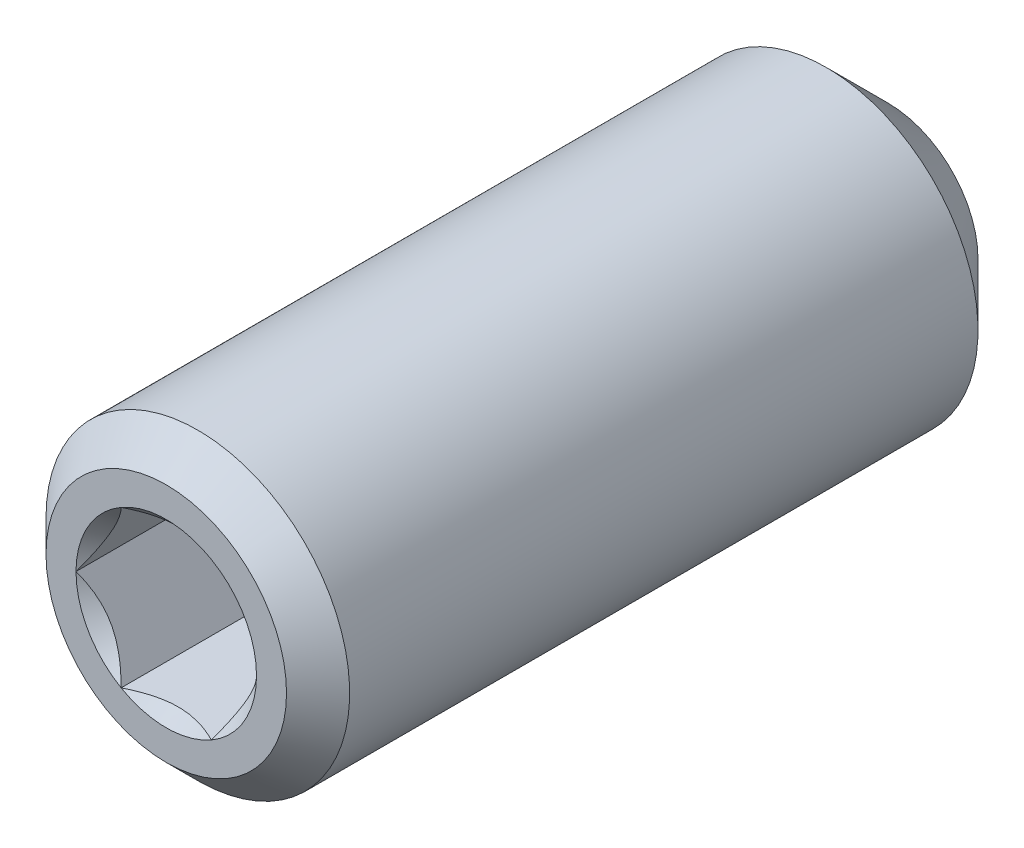
ISO-10303-21;
HEADER;
FILE_DESCRIPTION(('STEP AP214'),'2;1');
FILE_NAME('part.step','',(''),(''),'','','');
FILE_SCHEMA(('AUTOMOTIVE_DESIGN { 1 0 10303 214 1 1 1 1 }'));
ENDSEC;
DATA;
#1=APPLICATION_CONTEXT('core data for automotive mechanical design processes');
#2=APPLICATION_PROTOCOL_DEFINITION('international standard','automotive_design',2000,#1);
#3=PRODUCT_CONTEXT('',#1,'mechanical');
#4=PRODUCT('Part','Part','',(#3));
#5=PRODUCT_RELATED_PRODUCT_CATEGORY('part','',(#4));
#6=PRODUCT_DEFINITION_FORMATION('','',#4);
#7=PRODUCT_DEFINITION_CONTEXT('part definition',#1,'design');
#8=PRODUCT_DEFINITION('design','',#6,#7);
#9=PRODUCT_DEFINITION_SHAPE('','',#8);
#10=(LENGTH_UNIT() NAMED_UNIT(*) SI_UNIT(.MILLI.,.METRE.));
#11=(NAMED_UNIT(*) PLANE_ANGLE_UNIT() SI_UNIT($,.RADIAN.));
#12=(NAMED_UNIT(*) SI_UNIT($,.STERADIAN.) SOLID_ANGLE_UNIT());
#13=UNCERTAINTY_MEASURE_WITH_UNIT(LENGTH_MEASURE(1.E-05),#10,'distance_accuracy_value','');
#14=(GEOMETRIC_REPRESENTATION_CONTEXT(3) GLOBAL_UNCERTAINTY_ASSIGNED_CONTEXT((#13)) GLOBAL_UNIT_ASSIGNED_CONTEXT((#10,
#11,#12)) REPRESENTATION_CONTEXT('',''));
#15=CARTESIAN_POINT('',(0.,0.,0.));
#16=DIRECTION('',(0.,0.,1.));
#17=DIRECTION('',(1.,0.,0.));
#18=AXIS2_PLACEMENT_3D('',#15,#16,#17);
#19=CARTESIAN_POINT('',(-0.750555349947,0.,0.));
#20=DIRECTION('',(-0.866025403784329,-0.50000000000019,0.));
#21=DIRECTION('',(0.50000000000019,-0.866025403784329,0.));
#22=AXIS2_PLACEMENT_3D('',#19,#20,#21);
#23=PLANE('',#22);
#24=DIRECTION('',(0.,0.,1.));
#25=VECTOR('',#24,1.);
#26=CARTESIAN_POINT('',(-0.750555349946585,-2.39608680119296E-13,0.));
#27=LINE('',#26,#25);
#28=CARTESIAN_POINT('',(-0.750555349939481,-2.48189512564409E-13,-1.61614240464758));
#29=VERTEX_POINT('',#28);
#30=CARTESIAN_POINT('',(-0.750555349954952,3.38841107905888E-12,-5.46106603381807E-11));
#31=VERTEX_POINT('',#30);
#32=EDGE_CURVE('E85',#29,#31,#27,.T.);
#33=ORIENTED_EDGE('',*,*,#32,.T.);
#34=CARTESIAN_POINT('',(-0.375277674963107,-0.650000000018093,-5.24553175903493E-11));
#35=CARTESIAN_POINT('',(-0.388176726309613,-0.627658187716516,-0.0128852769110331));
#36=CARTESIAN_POINT('',(-0.401290579719728,-0.604944327327197,-0.0250148378954545));
#37=CARTESIAN_POINT('',(-0.428031078780609,-0.558628424334028,-0.0472236226643769));
#38=CARTESIAN_POINT('',(-0.441660266100098,-0.535021979430811,-0.0572904940137331));
#39=CARTESIAN_POINT('',(-0.469144594329594,-0.487417726525449,-0.0745327489037096));
#40=CARTESIAN_POINT('',(-0.482992712391925,-0.463432082452291,-0.0817515019675617));
#41=CARTESIAN_POINT('',(-0.510986892804128,-0.414944739662132,-0.0928821717346642));
#42=CARTESIAN_POINT('',(-0.525132117586038,-0.390444491655393,-0.0968023652147332));
#43=CARTESIAN_POINT('',(-0.559694522657562,-0.330580650039768,-0.101776897050455));
#44=CARTESIAN_POINT('',(-0.58019248275334,-0.295077141702378,-0.100873323666075));
#45=CARTESIAN_POINT('',(-0.620758505270054,-0.224814729642482,-0.0915850976183604));
#46=CARTESIAN_POINT('',(-0.640825881139146,-0.190057015062652,-0.0831892925864299));
#47=CARTESIAN_POINT('',(-0.676045362573794,-0.129055083801644,-0.0629573907277855));
#48=CARTESIAN_POINT('',(-0.691360313158306,-0.102528811273875,-0.0521824020748095));
#49=CARTESIAN_POINT('',(-0.721390903680165,-0.0505143027087448,-0.027911715791749));
#50=CARTESIAN_POINT('',(-0.736108311763912,-0.0250230041519825,-0.0144248747277939));
#51=CARTESIAN_POINT('',(-0.750555349957185,1.76412341284902E-11,-5.23779009665048E-11));
#52=B_SPLINE_CURVE_WITH_KNOTS('',3,(#34,#35,#36,#37,#38,#39,#40,#41,#42,#43,#44,#45,#46,#47,#48,
#49,#50,#51),.UNSPECIFIED.,.F.,.F.,(4,2,2,2,2,2,2,2,4),(0.,0.0865689152823222,0.173642001962946,
0.259332662444194,0.344807660426135,0.467047188368264,0.589468976886732,0.686740705162173,
0.783699770583737),.UNSPECIFIED.);
#53=CARTESIAN_POINT('',(-0.375277674978481,-0.650000000009047,-5.26027167599646E-11));
#54=VERTEX_POINT('',#53);
#55=EDGE_CURVE('E21',#54,#31,#52,.T.);
#56=ORIENTED_EDGE('',*,*,#55,.F.);
#57=DIRECTION('',(0.,0.,1.));
#58=VECTOR('',#57,1.);
#59=CARTESIAN_POINT('',(-0.375277674973,-0.65,0.));
#60=LINE('',#59,#58);
#61=CARTESIAN_POINT('',(-0.375277674976835,-0.649999999993837,-1.61614240464549));
#62=VERTEX_POINT('',#61);
#63=EDGE_CURVE('E154',#54,#62,#60,.F.);
#64=ORIENTED_EDGE('',*,*,#63,.T.);
#65=CARTESIAN_POINT('',(-0.750555349948663,-1.60702618759379E-11,-1.61614240465313));
#66=CARTESIAN_POINT('',(-0.734009567376881,-0.0286581360692253,-1.62605361911159));
#67=CARTESIAN_POINT('',(-0.71731011606058,-0.0575824342025853,-1.6350710690569));
#68=CARTESIAN_POINT('',(-0.683599170800418,-0.115971504160676,-1.65080660375776));
#69=CARTESIAN_POINT('',(-0.666586972151309,-0.145437496570717,-1.65751858360778));
#70=CARTESIAN_POINT('',(-0.632789561092063,-0.203976329690547,-1.66793300226252));
#71=CARTESIAN_POINT('',(-0.616010378963136,-0.23303872564694,-1.67171086670353));
#72=CARTESIAN_POINT('',(-0.582368823365506,-0.291307609187407,-1.67617675689356));
#73=CARTESIAN_POINT('',(-0.565506592594266,-0.320513849612226,-1.67686894246333));
#74=CARTESIAN_POINT('',(-0.534133469480445,-0.374853692837508,-1.67522540399731));
#75=CARTESIAN_POINT('',(-0.519616833477076,-0.399997243950295,-1.67329138993383));
#76=CARTESIAN_POINT('',(-0.490697507174176,-0.450086986427541,-1.66723105080883));
#77=CARTESIAN_POINT('',(-0.476294839174762,-0.475033139167064,-1.66310430695978));
#78=CARTESIAN_POINT('',(-0.447318770589634,-0.525221162160086,-1.65281205317731));
#79=CARTESIAN_POINT('',(-0.432749636471453,-0.550455642675047,-1.64659974996968));
#80=CARTESIAN_POINT('',(-0.403843431628553,-0.600522658116915,-1.63252326447357));
#81=CARTESIAN_POINT('',(-0.389505933825744,-0.625355932764774,-1.62466261783867));
#82=CARTESIAN_POINT('',(-0.375277674979914,-0.649999999988982,-1.61614240464709));
#83=B_SPLINE_CURVE_WITH_KNOTS('',3,(#65,#66,#67,#68,#69,#70,#71,#72,#73,#74,#75,#76,#77,#78,#79,
#80,#81,#82),.UNSPECIFIED.,.F.,.F.,(4,2,2,2,2,2,2,2,4),(0.,0.10367716907927,0.207626797157348,
0.308806623670866,0.409850007771033,0.497054791926755,0.584276237236673,0.673602367963235,
0.76273882127789),.UNSPECIFIED.);
#84=EDGE_CURVE('E83',#29,#62,#83,.T.);
#85=ORIENTED_EDGE('',*,*,#84,.F.);
#86=EDGE_LOOP('',(#33,#56,#64,#85));
#87=FACE_BOUND('',#86,.T.);
#88=ADVANCED_FACE('F17',(#87),#23,.F.);
#89=CARTESIAN_POINT('',(-0.375277674973,0.65,0.));
#90=DIRECTION('',(-0.866025403784329,0.50000000000019,0.));
#91=DIRECTION('',(-0.50000000000019,-0.866025403784329,0.));
#92=AXIS2_PLACEMENT_3D('',#89,#90,#91);
#93=PLANE('',#92);
#94=DIRECTION('',(0.,0.,1.));
#95=VECTOR('',#94,1.);
#96=CARTESIAN_POINT('',(-0.375277674973,0.65,0.));
#97=LINE('',#96,#95);
#98=CARTESIAN_POINT('',(-0.375277678015297,0.649999994730586,-1.61614240646535));
#99=VERTEX_POINT('',#98);
#100=CARTESIAN_POINT('',(-0.375277674974139,0.650000000008999,-5.48152481489516E-11));
#101=VERTEX_POINT('',#100);
#102=EDGE_CURVE('E108',#99,#101,#97,.T.);
#103=ORIENTED_EDGE('',*,*,#102,.T.);
#104=CARTESIAN_POINT('',(-0.750555349956909,-1.81201297615969E-11,-5.26543776156337E-11));
#105=CARTESIAN_POINT('',(-0.737656298610391,0.0223418122834764,-0.0128852769112619));
#106=CARTESIAN_POINT('',(-0.724542445200264,0.0450556726728163,-0.0250148378957128));
#107=CARTESIAN_POINT('',(-0.697801946139357,0.09137157566603,-0.0472236226646926));
#108=CARTESIAN_POINT('',(-0.684172758819854,0.114978020569271,-0.0572904940140764));
#109=CARTESIAN_POINT('',(-0.65668843059033,0.162582273474683,-0.0745327489041021));
#110=CARTESIAN_POINT('',(-0.642840312527984,0.186567917547866,-0.0817515019679759));
#111=CARTESIAN_POINT('',(-0.614846132115751,0.235055260338078,-0.0928821717351136));
#112=CARTESIAN_POINT('',(-0.600700907333825,0.259555508344844,-0.0968023652151962));
#113=CARTESIAN_POINT('',(-0.566138502262298,0.319419349960476,-0.101776897050932));
#114=CARTESIAN_POINT('',(-0.545640542166532,0.354922858297844,-0.100873323666561));
#115=CARTESIAN_POINT('',(-0.505074519649843,0.425185270357697,-0.0915850976188653));
#116=CARTESIAN_POINT('',(-0.485007143780764,0.459942984937506,-0.083189292586946));
#117=CARTESIAN_POINT('',(-0.449787662346105,0.520944916198534,-0.0629573907283046));
#118=CARTESIAN_POINT('',(-0.43447271176157,0.54747118872634,-0.0521824020753126));
#119=CARTESIAN_POINT('',(-0.404442121239668,0.599485697291543,-0.0279117157922108));
#120=CARTESIAN_POINT('',(-0.389724713155901,0.62497699584834,-0.0144248747282304));
#121=CARTESIAN_POINT('',(-0.375277674962609,0.650000000017997,-5.27870471803813E-11));
#122=B_SPLINE_CURVE_WITH_KNOTS('',3,(#104,#105,#106,#107,#108,#109,#110,#111,#112,#113,#114,
#115,#116,#117,#118,#119,#120,#121),.UNSPECIFIED.,.F.,.F.,(4,2,2,2,2,2,2,2,4),(0.,
0.0865689152824249,0.173642001963155,0.259332662444503,0.344807660426544,0.467047188368596,
0.589468976886988,0.686740705162567,0.783699770584271),.UNSPECIFIED.);
#123=EDGE_CURVE('E89',#31,#101,#122,.T.);
#124=ORIENTED_EDGE('',*,*,#123,.F.);
#125=ORIENTED_EDGE('',*,*,#32,.F.);
#126=CARTESIAN_POINT('',(-0.375277681057595,0.649999989461172,-1.61614240828726));
#127=CARTESIAN_POINT('',(-0.391823463525466,0.621341853575853,-1.62605362245236));
#128=CARTESIAN_POINT('',(-0.408522914740686,0.592417555612587,-1.63507107208264));
#129=CARTESIAN_POINT('',(-0.442233859791022,0.534028486014273,-1.65080660612539));
#130=CARTESIAN_POINT('',(-0.459246058331319,0.504562493794044,-1.65751858563274));
#131=CARTESIAN_POINT('',(-0.493043469172245,0.44602366105331,-1.66793300360798));
#132=CARTESIAN_POINT('',(-0.509822651192149,0.416961265285406,-1.67171086771072));
#133=CARTESIAN_POINT('',(-0.543464206557899,0.358692382146314,-1.67617675724721));
#134=CARTESIAN_POINT('',(-0.560326437206312,0.329486141934332,-1.67686894250143));
#135=CARTESIAN_POINT('',(-0.591699559802194,0.275146299606205,-1.67522540351505));
#136=CARTESIAN_POINT('',(-0.606216195412829,0.250002749173634,-1.67329138928411));
#137=CARTESIAN_POINT('',(-0.635135520930393,0.199913008056617,-1.66723104995964));
#138=CARTESIAN_POINT('',(-0.649538188537205,0.174966855997104,-1.66310430607864));
#139=CARTESIAN_POINT('',(-0.678514256321607,0.124778834390986,-1.65281205235699));
#140=CARTESIAN_POINT('',(-0.69308339003201,0.0995443545823155,-1.64659974924687));
#141=CARTESIAN_POINT('',(-0.721989594072825,0.0494773405296974,-1.6325232640452));
#142=CARTESIAN_POINT('',(-0.736327091481276,0.0246440665648856,-1.62466261760677));
#143=CARTESIAN_POINT('',(-0.750555349939348,1.22950168124009E-11,-1.61614240464767));
#144=B_SPLINE_CURVE_WITH_KNOTS('',3,(#126,#127,#128,#129,#130,#131,#132,#133,#134,#135,#136,
#137,#138,#139,#140,#141,#142,#143),.UNSPECIFIED.,.F.,.F.,(4,2,2,2,2,2,2,2,4),(0.,
0.103677168258148,0.207626795491255,0.308806621241869,0.409850004588057,0.497054786434584,
0.584276229433693,0.673602357711446,0.762738808594382),.UNSPECIFIED.);
#145=EDGE_CURVE('E109',#99,#29,#144,.T.);
#146=ORIENTED_EDGE('',*,*,#145,.F.);
#147=EDGE_LOOP('',(#103,#124,#125,#146));
#148=FACE_BOUND('',#147,.T.);
#149=ADVANCED_FACE('F106',(#148),#93,.F.);
#150=CARTESIAN_POINT('',(-0.375277674973,-0.65,0.));
#151=DIRECTION('',(0.,-1.,0.));
#152=DIRECTION('',(1.,0.,0.));
#153=AXIS2_PLACEMENT_3D('',#150,#151,#152);
#154=PLANE('',#153);
#155=ORIENTED_EDGE('',*,*,#63,.F.);
#156=CARTESIAN_POINT('',(0.375277674993781,-0.65,-5.2786871656832E-11));
#157=CARTESIAN_POINT('',(0.349479572300786,-0.65,-0.0128852769113645));
#158=CARTESIAN_POINT('',(0.323251865480571,-0.65,-0.025014837895786));
#159=CARTESIAN_POINT('',(0.269770867358843,-0.65,-0.0472236226647093));
#160=CARTESIAN_POINT('',(0.242512492719881,-0.65,-0.0572904940140661));
#161=CARTESIAN_POINT('',(0.187543836260923,-0.65,-0.074532748904044));
#162=CARTESIAN_POINT('',(0.159847600136277,-0.65,-0.0817515019678968));
#163=CARTESIAN_POINT('',(0.103859239311905,-0.65,-0.0928821717350008));
#164=CARTESIAN_POINT('',(0.0755687897481016,-0.65,-0.0968023652150705));
#165=CARTESIAN_POINT('',(0.00644397960510629,-0.65,-0.101776897050793));
#166=CARTESIAN_POINT('',(-0.0345519405864149,-0.65,-0.100873323666415));
#167=CARTESIAN_POINT('',(-0.115683985619771,-0.65,-0.091585097618707));
#168=CARTESIAN_POINT('',(-0.155818737357918,-0.65,-0.0831892925867818));
#169=CARTESIAN_POINT('',(-0.226257700227161,-0.65,-0.0629573907281466));
#170=CARTESIAN_POINT('',(-0.256887601396168,-0.65,-0.0521824020751729));
#171=CARTESIAN_POINT('',(-0.316948782439851,-0.65,-0.0279117157921169));
#172=CARTESIAN_POINT('',(-0.346383598607328,-0.65,-0.0144248747281639));
#173=CARTESIAN_POINT('',(-0.375277674993856,-0.65,-5.27500817907226E-11));
#174=B_SPLINE_CURVE_WITH_KNOTS('',3,(#156,#157,#158,#159,#160,#161,#162,#163,#164,#165,#166,
#167,#168,#169,#170,#171,#172,#173),.UNSPECIFIED.,.F.,.F.,(4,2,2,2,2,2,2,2,4),(0.,
0.0865689152823048,0.173642001962911,0.259332662444142,0.344807660426066,0.467047188368133,
0.589468976886541,0.68674070516196,0.783699770583503),.UNSPECIFIED.);
#175=CARTESIAN_POINT('',(0.375277674978195,-0.650000000008999,-5.27868746476451E-11));
#176=VERTEX_POINT('',#175);
#177=EDGE_CURVE('E70',#176,#54,#174,.T.);
#178=ORIENTED_EDGE('',*,*,#177,.F.);
#179=DIRECTION('',(0.,0.,1.));
#180=VECTOR('',#179,1.);
#181=CARTESIAN_POINT('',(0.375277674973,-0.65,0.));
#182=LINE('',#181,#180);
#183=CARTESIAN_POINT('',(0.37527766888494,-0.65,-1.61614240646639));
#184=VERTEX_POINT('',#183);
#185=EDGE_CURVE('E175',#176,#184,#182,.F.);
#186=ORIENTED_EDGE('',*,*,#185,.T.);
#187=CARTESIAN_POINT('',(-0.375277674958712,-0.65,-1.61614240464772));
#188=CARTESIAN_POINT('',(-0.342186109830375,-0.65,-1.62605361910872));
#189=CARTESIAN_POINT('',(-0.308787207206272,-0.65,-1.6350710690546));
#190=CARTESIAN_POINT('',(-0.241365316697711,-0.65,-1.65080660375515));
#191=CARTESIAN_POINT('',(-0.207340919402751,-0.65,-1.65751858360432));
#192=CARTESIAN_POINT('',(-0.13974609728334,-0.65,-1.6679330022602));
#193=CARTESIAN_POINT('',(-0.106187733021144,-0.65,-1.67171086670242));
#194=CARTESIAN_POINT('',(-0.0389046218159571,-0.65,-1.67617675689372));
#195=CARTESIAN_POINT('',(-0.00518016026788898,-0.65,-1.67686894246352));
#196=CARTESIAN_POINT('',(0.057566084934522,-0.65,-1.67522540402435));
#197=CARTESIAN_POINT('',(0.0865993559129873,-0.65,-1.67329139007121));
#198=CARTESIAN_POINT('',(0.144438006483394,-0.65,-1.6672310513154));
#199=CARTESIAN_POINT('',(0.173243341475113,-0.65,-1.66310430772534));
#200=CARTESIAN_POINT('',(0.231195476604752,-0.65,-1.65281205458811));
#201=CARTESIAN_POINT('',(0.260333743808769,-0.65,-1.64659975177179));
#202=CARTESIAN_POINT('',(0.318146151469885,-0.65,-1.63252326714224));
#203=CARTESIAN_POINT('',(0.346821146083006,-0.65,-1.62466262098204));
#204=CARTESIAN_POINT('',(0.37527766279688,-0.65,-1.61614240828933));
#205=B_SPLINE_CURVE_WITH_KNOTS('',3,(#187,#188,#189,#190,#191,#192,#193,#194,#195,#196,#197,
#198,#199,#200,#201,#202,#203,#204),.UNSPECIFIED.,.F.,.F.,(4,2,2,2,2,2,2,2,4),(0.,
0.103677169067642,0.207626797132179,0.308806623660138,0.409850007776093,0.497054788841835,
0.584276231057858,0.673602358514695,0.762738808586441),.UNSPECIFIED.);
#206=EDGE_CURVE('E143',#62,#184,#205,.T.);
#207=ORIENTED_EDGE('',*,*,#206,.F.);
#208=EDGE_LOOP('',(#155,#178,#186,#207));
#209=FACE_BOUND('',#208,.T.);
#210=ADVANCED_FACE('F132',(#209),#154,.F.);
#211=CARTESIAN_POINT('',(0.,0.,-1.642731945158));
#212=DIRECTION('',(1.,0.,0.));
#213=DIRECTION('',(0.,-1.,0.));
#214=AXIS2_PLACEMENT_3D('',#211,#212,#213);
#215=SPHERICAL_SURFACE('',#214,0.375277674973);
#216=CARTESIAN_POINT('',(0.,0.,-2.00328707268227));
#217=DIRECTION('',(0.,0.,1.));
#218=DIRECTION('',(1.,0.,0.));
#219=AXIS2_PLACEMENT_3D('',#216,#217,#218);
#220=CIRCLE('',#219,0.1040833000161);
#221=CARTESIAN_POINT('',(0.1040833000161,0.,-2.00328707268227));
#222=VERTEX_POINT('',#221);
#223=EDGE_CURVE('E204',#222,#222,#220,.T.);
#224=ORIENTED_EDGE('',*,*,#223,.T.);
#225=EDGE_LOOP('',(#224));
#226=FACE_BOUND('',#225,.T.);
#227=ADVANCED_FACE('F137',(#226),#215,.F.);
#228=CARTESIAN_POINT('',(0.375277674973,0.65,0.));
#229=DIRECTION('',(0.,1.,0.));
#230=DIRECTION('',(-1.,0.,0.));
#231=AXIS2_PLACEMENT_3D('',#228,#229,#230);
#232=PLANE('',#231);
#233=DIRECTION('',(0.,0.,1.));
#234=VECTOR('',#233,1.);
#235=CARTESIAN_POINT('',(0.375277674973415,0.65000000000024,0.));
#236=LINE('',#235,#234);
#237=CARTESIAN_POINT('',(0.375277624010534,0.650000013986467,-1.61614241264933));
#238=VERTEX_POINT('',#237);
#239=CARTESIAN_POINT('',(0.37527767497792,0.650000000008075,-5.372512381416E-11));
#240=VERTEX_POINT('',#239);
#241=EDGE_CURVE('E203',#238,#240,#236,.T.);
#242=ORIENTED_EDGE('',*,*,#241,.T.);
#243=CARTESIAN_POINT('',(-0.375277674993782,0.65,-5.27869550440485E-11));
#244=CARTESIAN_POINT('',(-0.349479572300788,0.65,-0.0128852769113636));
#245=CARTESIAN_POINT('',(-0.323251865480575,0.65,-0.0250148378957842));
#246=CARTESIAN_POINT('',(-0.269770867358852,0.65,-0.0472236226647062));
#247=CARTESIAN_POINT('',(-0.242512492719892,0.65,-0.0572904940140626));
#248=CARTESIAN_POINT('',(-0.187543836260933,0.65,-0.0745327489040413));
#249=CARTESIAN_POINT('',(-0.159847600136285,0.65,-0.0817515019678949));
#250=CARTESIAN_POINT('',(-0.10385923931191,0.65,-0.0928821717350003));
#251=CARTESIAN_POINT('',(-0.0755687897481041,0.65,-0.0968023652150705));
#252=CARTESIAN_POINT('',(-0.00644397960510518,0.65,-0.101776897050794));
#253=CARTESIAN_POINT('',(0.0345519405864175,0.65,-0.100873323666415));
#254=CARTESIAN_POINT('',(0.115683985619774,0.65,-0.0915850976187066));
#255=CARTESIAN_POINT('',(0.155818737357919,0.65,-0.0831892925867817));
#256=CARTESIAN_POINT('',(0.226257700226757,0.65,-0.0629573907282625));
#257=CARTESIAN_POINT('',(0.256887601395375,0.65,-0.0521824020754516));
#258=CARTESIAN_POINT('',(0.31694878243831,0.65,-0.0279117157927808));
#259=CARTESIAN_POINT('',(0.346383598605428,0.65,-0.01442487472905));
#260=CARTESIAN_POINT('',(0.37527767499161,0.65,-5.38725721333355E-11));
#261=B_SPLINE_CURVE_WITH_KNOTS('',3,(#243,#244,#245,#246,#247,#248,#249,#250,#251,#252,#253,
#254,#255,#256,#257,#258,#259,#260),.UNSPECIFIED.,.F.,.F.,(4,2,2,2,2,2,2,2,4),(0.,
0.0865689152822984,0.173642001962899,0.259332662444136,0.344807660426066,0.467047188368138,
0.589468976886541,0.686740705160702,0.783699770580996),.UNSPECIFIED.);
#262=EDGE_CURVE('E40',#101,#240,#261,.T.);
#263=ORIENTED_EDGE('',*,*,#262,.F.);
#264=ORIENTED_EDGE('',*,*,#102,.F.);
#265=CARTESIAN_POINT('',(-0.375277707261476,0.65,-1.61614239497535));
#266=CARTESIAN_POINT('',(-0.342186141635588,0.65,-1.62605361021846));
#267=CARTESIAN_POINT('',(-0.3087872385113,0.65,-1.63507106099958));
#268=CARTESIAN_POINT('',(-0.241365346950053,0.65,-1.65080659744307));
#269=CARTESIAN_POINT('',(-0.207340949102257,0.65,-1.65751857819907));
#270=CARTESIAN_POINT('',(-0.139746125822566,0.65,-1.66793299866886));
#271=CARTESIAN_POINT('',(-0.106187760954648,0.65,-1.67171086401725));
#272=CARTESIAN_POINT('',(-0.0389046484584447,0.65,-1.67617675595363));
#273=CARTESIAN_POINT('',(-0.00518018622522424,0.65,-1.67686894236281));
#274=CARTESIAN_POINT('',(0.057566055526699,0.65,-1.67522540547015));
#275=CARTESIAN_POINT('',(0.0865993223722197,0.65,-1.67329139263001));
#276=CARTESIAN_POINT('',(0.144437964803958,0.65,-1.66723105663874));
#277=CARTESIAN_POINT('',(0.173243295790025,0.65,-1.66310431470074));
#278=CARTESIAN_POINT('',(0.231195422830999,0.65,-1.65281206530619));
#279=CARTESIAN_POINT('',(0.260333685957208,0.65,-1.6465997645984));
#280=CARTESIAN_POINT('',(0.318146085633065,0.65,-1.63252328442952));
#281=CARTESIAN_POINT('',(0.346821076338056,0.65,-1.62466264061925));
#282=CARTESIAN_POINT('',(0.375277589197696,0.65,-1.61614243032704));
#283=B_SPLINE_CURVE_WITH_KNOTS('',3,(#265,#266,#267,#268,#269,#270,#271,#272,#273,#274,#275,
#276,#277,#278,#279,#280,#281,#282),.UNSPECIFIED.,.F.,.F.,(4,2,2,2,2,2,2,2,4),(0.,
0.103677171174221,0.207626801397782,0.308806630037089,0.409850016248557,0.497054784758284,
0.584276214398925,0.673602328582849,0.762738765498276),.UNSPECIFIED.);
#284=EDGE_CURVE('E176',#99,#238,#283,.T.);
#285=ORIENTED_EDGE('',*,*,#284,.T.);
#286=EDGE_LOOP('',(#242,#263,#264,#285));
#287=FACE_BOUND('',#286,.T.);
#288=ADVANCED_FACE('F190',(#287),#232,.F.);
#289=CARTESIAN_POINT('',(0.375277674973,-0.65,0.));
#290=DIRECTION('',(0.866025403784329,-0.50000000000019,0.));
#291=DIRECTION('',(0.50000000000019,0.866025403784329,0.));
#292=AXIS2_PLACEMENT_3D('',#289,#290,#291);
#293=PLANE('',#292);
#294=ORIENTED_EDGE('',*,*,#185,.F.);
#295=CARTESIAN_POINT('',(0.750555349955763,1.61363847457605E-11,-5.37996684739661E-11));
#296=CARTESIAN_POINT('',(0.737656298609314,-0.0223418122853423,-0.0128852769122808));
#297=CARTESIAN_POINT('',(0.724542445199256,-0.0450556726745612,-0.0250148378966072));
#298=CARTESIAN_POINT('',(0.697801946138496,-0.0913715756675213,-0.0472236226653492));
#299=CARTESIAN_POINT('',(0.68417275881907,-0.11497802057063,-0.0572904940146198));
#300=CARTESIAN_POINT('',(0.656688430589703,-0.162582273475768,-0.0745327489044448));
#301=CARTESIAN_POINT('',(0.642840312527438,-0.186567917548812,-0.0817515019682305));
#302=CARTESIAN_POINT('',(0.614846132115371,-0.235055260338736,-0.0928821717352271));
#303=CARTESIAN_POINT('',(0.600700907333531,-0.259555508345354,-0.0968023652152565));
#304=CARTESIAN_POINT('',(0.566138502262098,-0.319419349960822,-0.101776897050936));
#305=CARTESIAN_POINT('',(0.54564054216634,-0.354922858298176,-0.100873323666539));
#306=CARTESIAN_POINT('',(0.505074519649668,-0.425185270357999,-0.0915850976188029));
#307=CARTESIAN_POINT('',(0.485007143780597,-0.459942984937793,-0.0831892925868674));
#308=CARTESIAN_POINT('',(0.449787662345974,-0.520944916198758,-0.0629573907282165));
#309=CARTESIAN_POINT('',(0.434472711761467,-0.547471188726519,-0.0521824020752345));
#310=CARTESIAN_POINT('',(0.404442121239618,-0.599485697291631,-0.0279117157921642));
#311=CARTESIAN_POINT('',(0.389724713155876,-0.624976995848384,-0.0144248747282055));
#312=CARTESIAN_POINT('',(0.375277674962609,-0.650000000017998,-5.27869513222349E-11));
#313=B_SPLINE_CURVE_WITH_KNOTS('',3,(#295,#296,#297,#298,#299,#300,#301,#302,#303,#304,#305,
#306,#307,#308,#309,#310,#311,#312),.UNSPECIFIED.,.F.,.F.,(4,2,2,2,2,2,2,2,4),(0.,
0.0865689152818887,0.17364200196207,0.259332662442886,0.344807660424399,0.467047188366405,
0.589468976884756,0.686740705160176,0.783699770581713),.UNSPECIFIED.);
#314=CARTESIAN_POINT('',(0.75055534995592,2.07543517279634E-13,-5.36429495531485E-11));
#315=VERTEX_POINT('',#314);
#316=EDGE_CURVE('E168',#315,#176,#313,.T.);
#317=ORIENTED_EDGE('',*,*,#316,.F.);
#318=DIRECTION('',(0.,0.,1.));
#319=VECTOR('',#318,1.);
#320=CARTESIAN_POINT('',(0.750555349947,0.,0.));
#321=LINE('',#320,#319);
#322=CARTESIAN_POINT('',(0.750555348209446,-3.01152907814914E-09,-1.61614240568035));
#323=VERTEX_POINT('',#322);
#324=EDGE_CURVE('E291',#315,#323,#321,.F.);
#325=ORIENTED_EDGE('',*,*,#324,.T.);
#326=CARTESIAN_POINT('',(0.750555341873252,-4.35767917858742E-09,-1.61614240386834));
#327=CARTESIAN_POINT('',(0.734009562145646,-0.0286581416650854,-1.62605362008814));
#328=CARTESIAN_POINT('',(0.717310111946664,-0.0575824403987073,-1.63507107067693));
#329=CARTESIAN_POINT('',(0.683599167418591,-0.115971510948084,-1.65080660563806));
#330=CARTESIAN_POINT('',(0.666586968380525,-0.145437503347147,-1.65751858510456));
#331=CARTESIAN_POINT('',(0.632789556998878,-0.203976336539556,-1.6679330031986));
#332=CARTESIAN_POINT('',(0.616010374925866,-0.233038732574881,-1.67171086746196));
#333=CARTESIAN_POINT('',(0.58236881933833,-0.291307616225495,-1.67617675720693));
#334=CARTESIAN_POINT('',(0.565506588521353,-0.320513856681684,-1.67686894250816));
#335=CARTESIAN_POINT('',(0.534133464350137,-0.374853701708764,-1.67522540350571));
#336=CARTESIAN_POINT('',(0.519616827332166,-0.39999725458893,-1.67329138900895));
#337=CARTESIAN_POINT('',(0.490697499022503,-0.450087000549398,-1.66723104873825));
#338=CARTESIAN_POINT('',(0.476294830030937,-0.475033155004745,-1.66310430417664));
#339=CARTESIAN_POINT('',(0.447318759426709,-0.525221181492786,-1.65281204873627));
#340=CARTESIAN_POINT('',(0.432749624283041,-0.550455663784491,-1.64659974457204));
#341=CARTESIAN_POINT('',(0.403843417425538,-0.600522682716846,-1.63252325702133));
#342=CARTESIAN_POINT('',(0.389505918633522,-0.625355959078606,-1.62466260928891));
#343=CARTESIAN_POINT('',(0.37527765881174,-0.650000027992124,-1.61614239496515));
#344=B_SPLINE_CURVE_WITH_KNOTS('',3,(#326,#327,#328,#329,#330,#331,#332,#333,#334,#335,#336,
#337,#338,#339,#340,#341,#342,#343),.UNSPECIFIED.,.F.,.F.,(4,2,2,2,2,2,2,2,4),(0.,
0.103677169460282,0.207626797814286,0.30880662440973,0.409850008633122,0.497054798959714,
0.584276250445526,0.673602387783505,0.762738847685841),.UNSPECIFIED.);
#345=EDGE_CURVE('E196',#323,#184,#344,.T.);
#346=ORIENTED_EDGE('',*,*,#345,.T.);
#347=EDGE_LOOP('',(#294,#317,#325,#346));
#348=FACE_BOUND('',#347,.T.);
#349=ADVANCED_FACE('F186',(#348),#293,.F.);
#350=CARTESIAN_POINT('',(0.,0.,-1.6138195367148));
#351=DIRECTION('',(0.,0.,1.));
#352=DIRECTION('',(1.,0.,0.));
#353=AXIS2_PLACEMENT_3D('',#350,#351,#352);
#354=CONICAL_SURFACE('',#353,0.754434182113073,1.03121728661734);
#355=ORIENTED_EDGE('',*,*,#223,.F.);
#356=EDGE_LOOP('',(#355));
#357=FACE_BOUND('',#356,.T.);
#358=ORIENTED_EDGE('',*,*,#345,.F.);
#359=CARTESIAN_POINT('',(0.750555341873391,4.3579567560826E-09,-1.61614240386801));
#360=CARTESIAN_POINT('',(0.734009562146944,0.0286581416636379,-1.62605362008727));
#361=CARTESIAN_POINT('',(0.717310111949056,0.0575824403954798,-1.63507107067558));
#362=CARTESIAN_POINT('',(0.683599167423274,0.115971510940975,-1.65080660563596));
#363=CARTESIAN_POINT('',(0.666586968386406,0.145437503337931,-1.65751858510222));
#364=CARTESIAN_POINT('',(0.632789557004911,0.203976336530052,-1.66793300319696));
#365=CARTESIAN_POINT('',(0.616010374930824,0.233038732567248,-1.67171086746089));
#366=CARTESIAN_POINT('',(0.582368819340934,0.291307616221946,-1.67617675720653));
#367=CARTESIAN_POINT('',(0.565506588522676,0.320513856680349,-1.67686894250784));
#368=CARTESIAN_POINT('',(0.534133464604193,0.374853701269682,-1.67522540351877));
#369=CARTESIAN_POINT('',(0.519616827839612,0.399997253710967,-1.67329138907644));
#370=CARTESIAN_POINT('',(0.490697500031517,0.450086998802693,-1.66723104898782));
#371=CARTESIAN_POINT('',(0.476294831288128,0.475033152828185,-1.66310430455392));
#372=CARTESIAN_POINT('',(0.44731876118677,0.525221178445229,-1.65281204943167));
#373=CARTESIAN_POINT('',(0.432749626297509,0.550455660296288,-1.64659974546036));
#374=CARTESIAN_POINT('',(0.403843419938964,0.600522678364424,-1.63252325833685));
#375=CARTESIAN_POINT('',(0.389505921391538,0.62535595430254,-1.62466261083844));
#376=CARTESIAN_POINT('',(0.375277661810721,0.650000022798693,-1.61614239676062));
#377=B_SPLINE_CURVE_WITH_KNOTS('',3,(#359,#360,#361,#362,#363,#364,#365,#366,#367,#368,#369,
#370,#371,#372,#373,#374,#375,#376),.UNSPECIFIED.,.F.,.F.,(4,2,2,2,2,2,2,2,4),(0.,
0.10367716945387,0.207626797800606,0.308806624402733,0.409850008633436,0.497054797437094,
0.584276247398048,0.673602383124421,0.762738841428342),.UNSPECIFIED.);
#378=EDGE_CURVE('E205',#323,#238,#377,.T.);
#379=ORIENTED_EDGE('',*,*,#378,.T.);
#380=ORIENTED_EDGE('',*,*,#284,.F.);
#381=ORIENTED_EDGE('',*,*,#145,.T.);
#382=ORIENTED_EDGE('',*,*,#84,.T.);
#383=ORIENTED_EDGE('',*,*,#206,.T.);
#384=EDGE_LOOP('',(#358,#379,#380,#381,#382,#383));
#385=FACE_BOUND('',#384,.T.);
#386=ADVANCED_FACE('F189',(#357,#385),#354,.F.);
#387=CARTESIAN_POINT('',(0.750555349947,0.,0.));
#388=DIRECTION('',(0.866025403784329,0.50000000000019,0.));
#389=DIRECTION('',(-0.50000000000019,0.866025403784329,0.));
#390=AXIS2_PLACEMENT_3D('',#387,#388,#389);
#391=PLANE('',#390);
#392=ORIENTED_EDGE('',*,*,#324,.F.);
#393=CARTESIAN_POINT('',(0.750555349946323,-1.88215280178024E-11,-4.91018161234968E-11));
#394=CARTESIAN_POINT('',(0.737656298606248,0.0223418122844158,-0.0128852769102433));
#395=CARTESIAN_POINT('',(0.724542445198922,0.0450556726741653,-0.025014837895569));
#396=CARTESIAN_POINT('',(0.697801946140454,0.0913715756670324,-0.0472236226648635));
#397=CARTESIAN_POINT('',(0.684172758820569,0.114978020569509,-0.0572904940136846));
#398=CARTESIAN_POINT('',(0.656688430591203,0.16258227347362,-0.0745327489031126));
#399=CARTESIAN_POINT('',(0.642840312529384,0.186567917546262,-0.0817515019669473));
#400=CARTESIAN_POINT('',(0.614846132117975,0.235055260335322,-0.0928821717340922));
#401=CARTESIAN_POINT('',(0.600700907336345,0.25955550834148,-0.0968023652142172));
#402=CARTESIAN_POINT('',(0.566138502265255,0.319419349956251,-0.101776897050368));
#403=CARTESIAN_POINT('',(0.545640542169645,0.354922858293392,-0.100873323666355));
#404=CARTESIAN_POINT('',(0.505074519653189,0.425185270352875,-0.0915850976194122));
#405=CARTESIAN_POINT('',(0.485007143784185,0.459942984932542,-0.0831892925878812));
#406=CARTESIAN_POINT('',(0.449787662349328,0.520944916193904,-0.0629573907297267));
#407=CARTESIAN_POINT('',(0.434472711764534,0.547471188722161,-0.0521824020767637));
#408=CARTESIAN_POINT('',(0.404442121242147,0.59948569728821,-0.0279117157936091));
#409=CARTESIAN_POINT('',(0.389724713158153,0.624976995845402,-0.0144248747295502));
#410=CARTESIAN_POINT('',(0.375277674964642,0.650000000015434,-5.39904038671566E-11));
#411=B_SPLINE_CURVE_WITH_KNOTS('',3,(#393,#394,#395,#396,#397,#398,#399,#400,#401,#402,#403,
#404,#405,#406,#407,#408,#409,#410),.UNSPECIFIED.,.F.,.F.,(4,2,2,2,2,2,2,2,4),(0.,
0.0865689152806722,0.173642001959417,0.259332662438672,0.344807660418721,0.467047188359953,
0.589468976877624,0.686740705154637,0.783699770577669),.UNSPECIFIED.);
#412=EDGE_CURVE('E238',#315,#240,#411,.T.);
#413=ORIENTED_EDGE('',*,*,#412,.T.);
#414=ORIENTED_EDGE('',*,*,#241,.F.);
#415=ORIENTED_EDGE('',*,*,#378,.F.);
#416=EDGE_LOOP('',(#392,#413,#414,#415));
#417=FACE_BOUND('',#416,.T.);
#418=ADVANCED_FACE('F164',(#417),#391,.F.);
#419=CARTESIAN_POINT('',(0.,0.,-1.13686837721616E-10));
#420=DIRECTION('',(0.,0.,1.));
#421=DIRECTION('',(1.,0.,0.));
#422=AXIS2_PLACEMENT_3D('',#419,#420,#421);
#423=CONICAL_SURFACE('',#422,0.750555349895876,0.785398163397448);
#424=ORIENTED_EDGE('',*,*,#316,.T.);
#425=CARTESIAN_POINT('',(0.,0.,-5.6843418860808E-11));
#426=DIRECTION('',(0.,0.,1.));
#427=DIRECTION('',(1.,0.,0.));
#428=AXIS2_PLACEMENT_3D('',#425,#426,#427);
#429=CIRCLE('',#428,0.75055534995272);
#430=EDGE_CURVE('E237',#315,#176,#429,.F.);
#431=ORIENTED_EDGE('',*,*,#430,.F.);
#432=EDGE_LOOP('',(#424,#431));
#433=FACE_BOUND('',#432,.T.);
#434=ADVANCED_FACE('F159',(#433),#423,.F.);
#435=CARTESIAN_POINT('',(0.,0.,-1.13686837721616E-10));
#436=DIRECTION('',(0.,0.,1.));
#437=DIRECTION('',(1.,0.,0.));
#438=AXIS2_PLACEMENT_3D('',#435,#436,#437);
#439=CONICAL_SURFACE('',#438,0.750555349895876,0.785398163397448);
#440=ORIENTED_EDGE('',*,*,#177,.T.);
#441=CARTESIAN_POINT('',(0.,0.,-5.6843418860808E-11));
#442=DIRECTION('',(0.,0.,1.));
#443=DIRECTION('',(1.,0.,0.));
#444=AXIS2_PLACEMENT_3D('',#441,#442,#443);
#445=CIRCLE('',#444,0.75055534995272);
#446=EDGE_CURVE('E99',#176,#54,#445,.F.);
#447=ORIENTED_EDGE('',*,*,#446,.F.);
#448=EDGE_LOOP('',(#440,#447));
#449=FACE_BOUND('',#448,.T.);
#450=ADVANCED_FACE('F155',(#449),#439,.F.);
#451=CARTESIAN_POINT('',(0.,0.,-1.13686837721616E-10));
#452=DIRECTION('',(0.,0.,1.));
#453=DIRECTION('',(1.,0.,0.));
#454=AXIS2_PLACEMENT_3D('',#451,#452,#453);
#455=CONICAL_SURFACE('',#454,0.750555349895876,0.785398163397448);
#456=ORIENTED_EDGE('',*,*,#55,.T.);
#457=CARTESIAN_POINT('',(0.,0.,-5.6843418860808E-11));
#458=DIRECTION('',(0.,0.,1.));
#459=DIRECTION('',(1.,0.,0.));
#460=AXIS2_PLACEMENT_3D('',#457,#458,#459);
#461=CIRCLE('',#460,0.75055534995272);
#462=EDGE_CURVE('E79',#54,#31,#461,.F.);
#463=ORIENTED_EDGE('',*,*,#462,.F.);
#464=EDGE_LOOP('',(#456,#463));
#465=FACE_BOUND('',#464,.T.);
#466=ADVANCED_FACE('F77',(#465),#455,.F.);
#467=CARTESIAN_POINT('',(0.,0.,-1.13686837721616E-10));
#468=DIRECTION('',(0.,0.,1.));
#469=DIRECTION('',(1.,0.,0.));
#470=AXIS2_PLACEMENT_3D('',#467,#468,#469);
#471=CONICAL_SURFACE('',#470,0.750555349895876,0.785398163397448);
#472=CARTESIAN_POINT('',(0.,0.,-5.6843418860808E-11));
#473=DIRECTION('',(0.,0.,1.));
#474=DIRECTION('',(1.,0.,0.));
#475=AXIS2_PLACEMENT_3D('',#472,#473,#474);
#476=CIRCLE('',#475,0.75055534995272);
#477=EDGE_CURVE('E97',#31,#101,#476,.F.);
#478=ORIENTED_EDGE('',*,*,#477,.F.);
#479=ORIENTED_EDGE('',*,*,#123,.T.);
#480=EDGE_LOOP('',(#478,#479));
#481=FACE_BOUND('',#480,.T.);
#482=ADVANCED_FACE('F102',(#481),#471,.F.);
#483=CARTESIAN_POINT('',(0.,0.,-1.13686837721616E-10));
#484=DIRECTION('',(0.,0.,1.));
#485=DIRECTION('',(1.,0.,0.));
#486=AXIS2_PLACEMENT_3D('',#483,#484,#485);
#487=CONICAL_SURFACE('',#486,0.750555349895876,0.785398163397448);
#488=CARTESIAN_POINT('',(0.,0.,-5.6843418860808E-11));
#489=DIRECTION('',(0.,0.,1.));
#490=DIRECTION('',(1.,0.,0.));
#491=AXIS2_PLACEMENT_3D('',#488,#489,#490);
#492=CIRCLE('',#491,0.75055534995272);
#493=EDGE_CURVE('E104',#101,#240,#492,.F.);
#494=ORIENTED_EDGE('',*,*,#493,.F.);
#495=ORIENTED_EDGE('',*,*,#262,.T.);
#496=EDGE_LOOP('',(#494,#495));
#497=FACE_BOUND('',#496,.T.);
#498=ADVANCED_FACE('F250',(#497),#487,.F.);
#499=CARTESIAN_POINT('',(0.,0.,-1.13686837721616E-10));
#500=DIRECTION('',(0.,0.,1.));
#501=DIRECTION('',(1.,0.,0.));
#502=AXIS2_PLACEMENT_3D('',#499,#500,#501);
#503=CONICAL_SURFACE('',#502,0.750555349895876,0.785398163397448);
#504=CARTESIAN_POINT('',(0.,0.,-5.6843418860808E-11));
#505=DIRECTION('',(0.,0.,1.));
#506=DIRECTION('',(1.,0.,0.));
#507=AXIS2_PLACEMENT_3D('',#504,#505,#506);
#508=CIRCLE('',#507,0.75055534995272);
#509=EDGE_CURVE('E232',#240,#315,#508,.F.);
#510=ORIENTED_EDGE('',*,*,#509,.F.);
#511=ORIENTED_EDGE('',*,*,#412,.F.);
#512=EDGE_LOOP('',(#510,#511));
#513=FACE_BOUND('',#512,.T.);
#514=ADVANCED_FACE('F245',(#513),#503,.F.);
#515=CARTESIAN_POINT('',(0.,0.,-6.00000000002865));
#516=DIRECTION('',(0.,0.,-1.));
#517=DIRECTION('',(-1.,0.,0.));
#518=AXIS2_PLACEMENT_3D('',#515,#516,#517);
#519=CONICAL_SURFACE('',#518,0.749999999982265,1.04719755107997);
#520=CARTESIAN_POINT('',(0.,0.,-5.99999999997181));
#521=DIRECTION('',(0.,0.,1.));
#522=DIRECTION('',(1.,0.,0.));
#523=AXIS2_PLACEMENT_3D('',#520,#521,#522);
#524=CIRCLE('',#523,0.749999999982265);
#525=CARTESIAN_POINT('',(0.749999999982265,0.,-5.99999999997181));
#526=VERTEX_POINT('',#525);
#527=EDGE_CURVE('E231',#526,#526,#524,.T.);
#528=ORIENTED_EDGE('',*,*,#527,.F.);
#529=EDGE_LOOP('',(#528));
#530=FACE_BOUND('',#529,.T.);
#531=CARTESIAN_POINT('',(-1.13686837721616E-10,0.,-5.56698729809568));
#532=VERTEX_POINT('',#531);
#533=VERTEX_LOOP('',#532);
#534=FACE_BOUND('',#533,.T.);
#535=ADVANCED_FACE('F249',(#530,#534),#519,.F.);
#536=CARTESIAN_POINT('',(0.,0.,0.));
#537=DIRECTION('',(0.,0.,1.));
#538=DIRECTION('',(1.,0.,0.));
#539=AXIS2_PLACEMENT_3D('',#536,#537,#538);
#540=PLANE('',#539);
#541=ORIENTED_EDGE('',*,*,#493,.T.);
#542=ORIENTED_EDGE('',*,*,#509,.T.);
#543=ORIENTED_EDGE('',*,*,#430,.T.);
#544=ORIENTED_EDGE('',*,*,#446,.T.);
#545=ORIENTED_EDGE('',*,*,#462,.T.);
#546=ORIENTED_EDGE('',*,*,#477,.T.);
#547=EDGE_LOOP('',(#541,#542,#543,#544,#545,#546));
#548=FACE_BOUND('',#547,.T.);
#549=CARTESIAN_POINT('',(0.,0.,0.));
#550=DIRECTION('',(0.,0.,-1.));
#551=DIRECTION('',(-1.,0.,0.));
#552=AXIS2_PLACEMENT_3D('',#549,#550,#551);
#553=CIRCLE('',#552,0.999999999976353);
#554=CARTESIAN_POINT('',(-0.999999999976353,0.,0.));
#555=VERTEX_POINT('',#554);
#556=EDGE_CURVE('E228',#555,#555,#553,.T.);
#557=ORIENTED_EDGE('',*,*,#556,.F.);
#558=EDGE_LOOP('',(#557));
#559=FACE_BOUND('',#558,.T.);
#560=ADVANCED_FACE('F95',(#548,#559),#540,.T.);
#561=CARTESIAN_POINT('',(0.,0.,-5.48750000001519));
#562=DIRECTION('',(0.,0.,1.));
#563=DIRECTION('',(1.,0.,0.));
#564=AXIS2_PLACEMENT_3D('',#561,#562,#563);
#565=CONICAL_SURFACE('',#564,1.26249999993888,0.785398163397448);
#566=ORIENTED_EDGE('',*,*,#527,.T.);
#567=EDGE_LOOP('',(#566));
#568=FACE_BOUND('',#567,.T.);
#569=CARTESIAN_POINT('',(0.,0.,-5.4875));
#570=DIRECTION('',(0.,0.,-1.));
#571=DIRECTION('',(-1.,0.,0.));
#572=AXIS2_PLACEMENT_3D('',#569,#570,#571);
#573=CIRCLE('',#572,1.2625);
#574=CARTESIAN_POINT('',(-1.2625,0.,-5.4875));
#575=VERTEX_POINT('',#574);
#576=EDGE_CURVE('E32',#575,#575,#573,.F.);
#577=ORIENTED_EDGE('',*,*,#576,.F.);
#578=EDGE_LOOP('',(#577));
#579=FACE_BOUND('',#578,.T.);
#580=ADVANCED_FACE('F267',(#568,#579),#565,.T.);
#581=CARTESIAN_POINT('',(0.,0.,-0.262500000019373));
#582=DIRECTION('',(0.,0.,-1.));
#583=DIRECTION('',(-1.,0.,0.));
#584=AXIS2_PLACEMENT_3D('',#581,#582,#583);
#585=CONICAL_SURFACE('',#584,1.26250000005257,0.785398163505721);
#586=CARTESIAN_POINT('',(0.,0.,-0.2625));
#587=DIRECTION('',(0.,0.,-1.));
#588=DIRECTION('',(-1.,0.,0.));
#589=AXIS2_PLACEMENT_3D('',#586,#587,#588);
#590=CIRCLE('',#589,1.2625);
#591=CARTESIAN_POINT('',(-1.2625,0.,-0.2625));
#592=VERTEX_POINT('',#591);
#593=EDGE_CURVE('E11',#592,#592,#590,.T.);
#594=ORIENTED_EDGE('',*,*,#593,.F.);
#595=EDGE_LOOP('',(#594));
#596=FACE_BOUND('',#595,.T.);
#597=ORIENTED_EDGE('',*,*,#556,.T.);
#598=EDGE_LOOP('',(#597));
#599=FACE_BOUND('',#598,.T.);
#600=ADVANCED_FACE('F261',(#596,#599),#585,.T.);
#601=CARTESIAN_POINT('',(0.,0.,-0.2625));
#602=DIRECTION('',(0.,0.,-1.));
#603=DIRECTION('',(-1.,0.,0.));
#604=AXIS2_PLACEMENT_3D('',#601,#602,#603);
#605=CYLINDRICAL_SURFACE('',#604,1.2625);
#606=ORIENTED_EDGE('',*,*,#576,.T.);
#607=EDGE_LOOP('',(#606));
#608=FACE_BOUND('',#607,.T.);
#609=ORIENTED_EDGE('',*,*,#593,.T.);
#610=EDGE_LOOP('',(#609));
#611=FACE_BOUND('',#610,.T.);
#612=ADVANCED_FACE('F259',(#608,#611),#605,.T.);
#613=CLOSED_SHELL('',(#88,#149,#210,#227,#288,#349,#386,#418,#434,#450,#466,#482,#498,#514,#535,
#560,#580,#600,#612));
#614=MANIFOLD_SOLID_BREP('B1',#613);
#615=ADVANCED_BREP_SHAPE_REPRESENTATION('',(#18,#614),#14);
#616=SHAPE_DEFINITION_REPRESENTATION(#9,#615);
ENDSEC;
END-ISO-10303-21;
